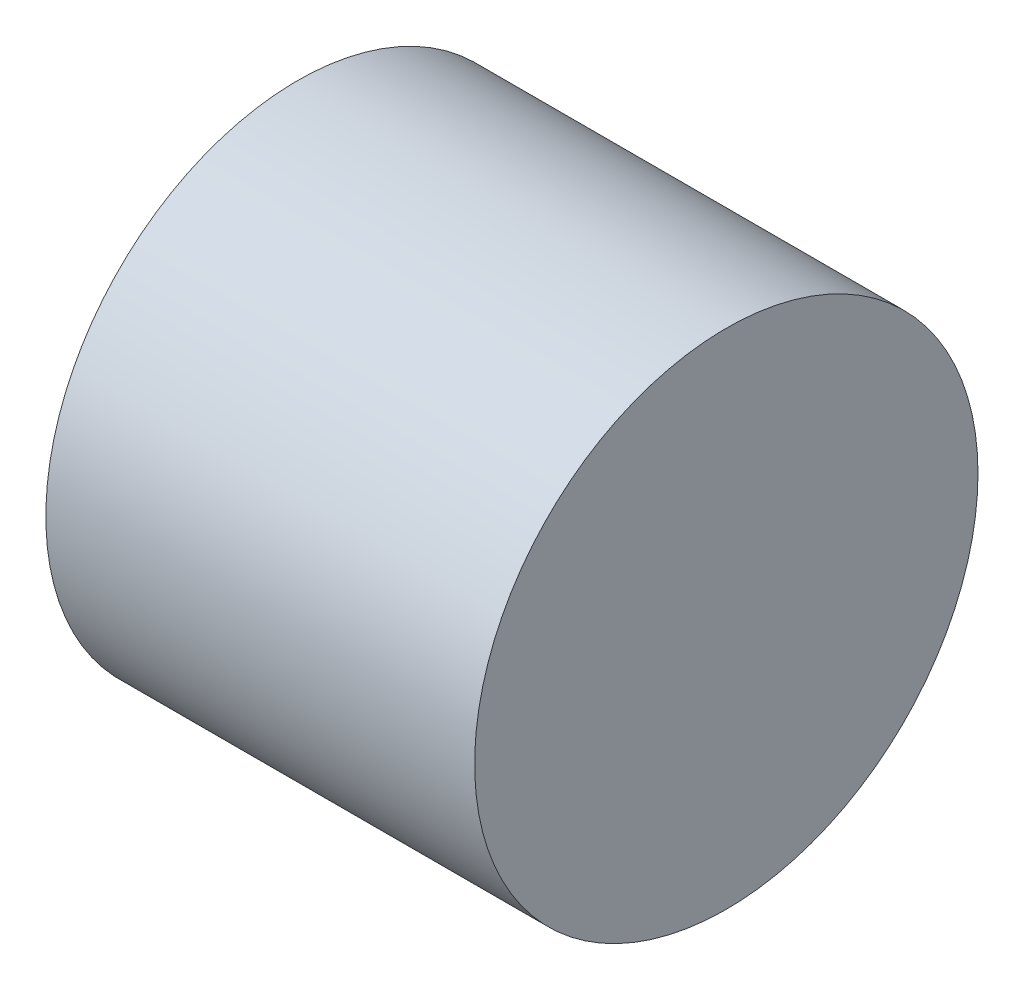
ISO-10303-21;
HEADER;
FILE_DESCRIPTION(('STEP AP214'),'2;1');
FILE_NAME('part.step','',(''),(''),'','','');
FILE_SCHEMA(('AUTOMOTIVE_DESIGN { 1 0 10303 214 1 1 1 1 }'));
ENDSEC;
DATA;
#1=APPLICATION_CONTEXT('core data for automotive mechanical design processes');
#2=APPLICATION_PROTOCOL_DEFINITION('international standard','automotive_design',2000,#1);
#3=PRODUCT_CONTEXT('',#1,'mechanical');
#4=PRODUCT('Part','Part','',(#3));
#5=PRODUCT_RELATED_PRODUCT_CATEGORY('part','',(#4));
#6=PRODUCT_DEFINITION_FORMATION('','',#4);
#7=PRODUCT_DEFINITION_CONTEXT('part definition',#1,'design');
#8=PRODUCT_DEFINITION('design','',#6,#7);
#9=PRODUCT_DEFINITION_SHAPE('','',#8);
#10=(LENGTH_UNIT() NAMED_UNIT(*) SI_UNIT(.MILLI.,.METRE.));
#11=(NAMED_UNIT(*) PLANE_ANGLE_UNIT() SI_UNIT($,.RADIAN.));
#12=(NAMED_UNIT(*) SI_UNIT($,.STERADIAN.) SOLID_ANGLE_UNIT());
#13=UNCERTAINTY_MEASURE_WITH_UNIT(LENGTH_MEASURE(1.E-05),#10,'distance_accuracy_value','');
#14=(GEOMETRIC_REPRESENTATION_CONTEXT(3) GLOBAL_UNCERTAINTY_ASSIGNED_CONTEXT((#13)) GLOBAL_UNIT_ASSIGNED_CONTEXT((#10,
#11,#12)) REPRESENTATION_CONTEXT('',''));
#15=CARTESIAN_POINT('',(0.,0.,0.));
#16=DIRECTION('',(0.,0.,1.));
#17=DIRECTION('',(1.,0.,0.));
#18=AXIS2_PLACEMENT_3D('',#15,#16,#17);
#19=CARTESIAN_POINT('',(46.,0.,0.));
#20=DIRECTION('',(-1.,0.,0.));
#21=DIRECTION('',(0.,0.,1.));
#22=AXIS2_PLACEMENT_3D('',#19,#20,#21);
#23=CYLINDRICAL_SURFACE('',#22,27.);
#24=CARTESIAN_POINT('',(46.,0.,0.));
#25=DIRECTION('',(1.,0.,0.));
#26=DIRECTION('',(0.,0.,-1.));
#27=AXIS2_PLACEMENT_3D('',#24,#25,#26);
#28=CIRCLE('',#27,27.);
#29=CARTESIAN_POINT('',(46.,0.,-27.));
#30=VERTEX_POINT('',#29);
#31=EDGE_CURVE('E10',#30,#30,#28,.T.);
#32=ORIENTED_EDGE('',*,*,#31,.F.);
#33=EDGE_LOOP('',(#32));
#34=FACE_BOUND('',#33,.T.);
#35=CARTESIAN_POINT('',(0.,0.,0.));
#36=DIRECTION('',(1.,0.,0.));
#37=DIRECTION('',(0.,0.,-1.));
#38=AXIS2_PLACEMENT_3D('',#35,#36,#37);
#39=CIRCLE('',#38,27.);
#40=CARTESIAN_POINT('',(0.,0.,-27.));
#41=VERTEX_POINT('',#40);
#42=EDGE_CURVE('E34',#41,#41,#39,.T.);
#43=ORIENTED_EDGE('',*,*,#42,.T.);
#44=EDGE_LOOP('',(#43));
#45=FACE_BOUND('',#44,.T.);
#46=ADVANCED_FACE('F31',(#34,#45),#23,.T.);
#47=CARTESIAN_POINT('',(46.,0.,0.));
#48=DIRECTION('',(1.,0.,0.));
#49=DIRECTION('',(0.,0.,-1.));
#50=AXIS2_PLACEMENT_3D('',#47,#48,#49);
#51=PLANE('',#50);
#52=ORIENTED_EDGE('',*,*,#31,.T.);
#53=EDGE_LOOP('',(#52));
#54=FACE_BOUND('',#53,.T.);
#55=ADVANCED_FACE('F46',(#54),#51,.T.);
#56=CARTESIAN_POINT('',(0.,0.,0.));
#57=DIRECTION('',(1.,0.,0.));
#58=DIRECTION('',(0.,0.,-1.));
#59=AXIS2_PLACEMENT_3D('',#56,#57,#58);
#60=PLANE('',#59);
#61=ORIENTED_EDGE('',*,*,#42,.F.);
#62=EDGE_LOOP('',(#61));
#63=FACE_BOUND('',#62,.T.);
#64=ADVANCED_FACE('F44',(#63),#60,.F.);
#65=CLOSED_SHELL('',(#46,#55,#64));
#66=MANIFOLD_SOLID_BREP('B2',#65);
#67=ADVANCED_BREP_SHAPE_REPRESENTATION('',(#18,#66),#14);
#68=SHAPE_DEFINITION_REPRESENTATION(#9,#67);
ENDSEC;
END-ISO-10303-21;
